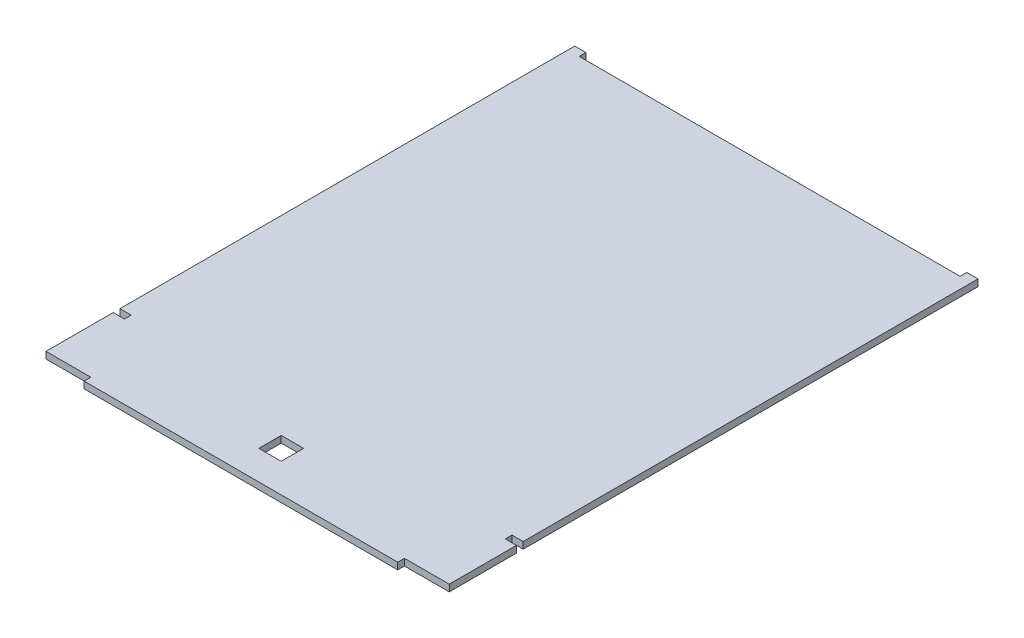
ISO-10303-21;
HEADER;
FILE_DESCRIPTION(('STEP AP214'),'2;1');
FILE_NAME('part.step','',(''),(''),'','','');
FILE_SCHEMA(('AUTOMOTIVE_DESIGN { 1 0 10303 214 1 1 1 1 }'));
ENDSEC;
DATA;
#1=APPLICATION_CONTEXT('core data for automotive mechanical design processes');
#2=APPLICATION_PROTOCOL_DEFINITION('international standard','automotive_design',2000,#1);
#3=PRODUCT_CONTEXT('',#1,'mechanical');
#4=PRODUCT('Part','Part','',(#3));
#5=PRODUCT_RELATED_PRODUCT_CATEGORY('part','',(#4));
#6=PRODUCT_DEFINITION_FORMATION('','',#4);
#7=PRODUCT_DEFINITION_CONTEXT('part definition',#1,'design');
#8=PRODUCT_DEFINITION('design','',#6,#7);
#9=PRODUCT_DEFINITION_SHAPE('','',#8);
#10=(LENGTH_UNIT() NAMED_UNIT(*) SI_UNIT(.MILLI.,.METRE.));
#11=(NAMED_UNIT(*) PLANE_ANGLE_UNIT() SI_UNIT($,.RADIAN.));
#12=(NAMED_UNIT(*) SI_UNIT($,.STERADIAN.) SOLID_ANGLE_UNIT());
#13=UNCERTAINTY_MEASURE_WITH_UNIT(LENGTH_MEASURE(1.E-05),#10,'distance_accuracy_value','');
#14=(GEOMETRIC_REPRESENTATION_CONTEXT(3) GLOBAL_UNCERTAINTY_ASSIGNED_CONTEXT((#13)) GLOBAL_UNIT_ASSIGNED_CONTEXT((#10,
#11,#12)) REPRESENTATION_CONTEXT('',''));
#15=CARTESIAN_POINT('',(0.,0.,0.));
#16=DIRECTION('',(0.,0.,1.));
#17=DIRECTION('',(1.,0.,0.));
#18=AXIS2_PLACEMENT_3D('',#15,#16,#17);
#19=CARTESIAN_POINT('',(0.,3.,3.));
#20=DIRECTION('',(0.,0.,-1.));
#21=DIRECTION('',(-1.,0.,0.));
#22=AXIS2_PLACEMENT_3D('',#19,#20,#21);
#23=PLANE('',#22);
#24=DIRECTION('',(1.,0.,0.));
#25=VECTOR('',#24,1.);
#26=CARTESIAN_POINT('',(0.,0.,3.));
#27=LINE('',#26,#25);
#28=CARTESIAN_POINT('',(160.,0.,3.));
#29=VERTEX_POINT('',#28);
#30=CARTESIAN_POINT('',(180.,0.,3.));
#31=VERTEX_POINT('',#30);
#32=EDGE_CURVE('E257',#29,#31,#27,.T.);
#33=ORIENTED_EDGE('',*,*,#32,.T.);
#34=DIRECTION('',(0.,-1.,0.));
#35=VECTOR('',#34,1.);
#36=CARTESIAN_POINT('',(180.,3.,3.));
#37=LINE('',#36,#35);
#38=CARTESIAN_POINT('',(180.,3.,3.));
#39=VERTEX_POINT('',#38);
#40=EDGE_CURVE('E11',#39,#31,#37,.T.);
#41=ORIENTED_EDGE('',*,*,#40,.F.);
#42=DIRECTION('',(1.,0.,0.));
#43=VECTOR('',#42,1.);
#44=CARTESIAN_POINT('',(0.,3.,3.));
#45=LINE('',#44,#43);
#46=CARTESIAN_POINT('',(160.,3.,3.));
#47=VERTEX_POINT('',#46);
#48=EDGE_CURVE('E414',#47,#39,#45,.T.);
#49=ORIENTED_EDGE('',*,*,#48,.F.);
#50=DIRECTION('',(0.,-1.,0.));
#51=VECTOR('',#50,1.);
#52=CARTESIAN_POINT('',(160.,3.,3.));
#53=LINE('',#52,#51);
#54=EDGE_CURVE('E329',#47,#29,#53,.T.);
#55=ORIENTED_EDGE('',*,*,#54,.T.);
#56=EDGE_LOOP('',(#33,#41,#49,#55));
#57=FACE_BOUND('',#56,.T.);
#58=ADVANCED_FACE('F39',(#57),#23,.F.);
#59=CARTESIAN_POINT('',(180.,3.,0.));
#60=DIRECTION('',(-1.,0.,0.));
#61=DIRECTION('',(0.,0.,1.));
#62=AXIS2_PLACEMENT_3D('',#59,#60,#61);
#63=PLANE('',#62);
#64=DIRECTION('',(0.,0.,-1.));
#65=VECTOR('',#64,1.);
#66=CARTESIAN_POINT('',(180.,0.,0.));
#67=LINE('',#66,#65);
#68=CARTESIAN_POINT('',(180.,0.,-27.));
#69=VERTEX_POINT('',#68);
#70=EDGE_CURVE('E261',#31,#69,#67,.T.);
#71=ORIENTED_EDGE('',*,*,#70,.T.);
#72=DIRECTION('',(0.,-1.,0.));
#73=VECTOR('',#72,1.);
#74=CARTESIAN_POINT('',(180.,3.,-27.));
#75=LINE('',#74,#73);
#76=CARTESIAN_POINT('',(180.,3.,-27.));
#77=VERTEX_POINT('',#76);
#78=EDGE_CURVE('E50',#77,#69,#75,.T.);
#79=ORIENTED_EDGE('',*,*,#78,.F.);
#80=DIRECTION('',(0.,0.,-1.));
#81=VECTOR('',#80,1.);
#82=CARTESIAN_POINT('',(180.,3.,0.));
#83=LINE('',#82,#81);
#84=EDGE_CURVE('E417',#39,#77,#83,.T.);
#85=ORIENTED_EDGE('',*,*,#84,.F.);
#86=ORIENTED_EDGE('',*,*,#40,.T.);
#87=EDGE_LOOP('',(#71,#79,#85,#86));
#88=FACE_BOUND('',#87,.T.);
#89=ADVANCED_FACE('F499',(#88),#63,.F.);
#90=CARTESIAN_POINT('',(0.,3.,-27.));
#91=DIRECTION('',(0.,0.,-1.));
#92=DIRECTION('',(-1.,0.,0.));
#93=AXIS2_PLACEMENT_3D('',#90,#91,#92);
#94=PLANE('',#93);
#95=DIRECTION('',(1.,0.,0.));
#96=VECTOR('',#95,1.);
#97=CARTESIAN_POINT('',(0.,0.,-27.));
#98=LINE('',#97,#96);
#99=CARTESIAN_POINT('',(175.,0.,-27.));
#100=VERTEX_POINT('',#99);
#101=EDGE_CURVE('E265',#100,#69,#98,.T.);
#102=ORIENTED_EDGE('',*,*,#101,.F.);
#103=DIRECTION('',(0.,-1.,0.));
#104=VECTOR('',#103,1.);
#105=CARTESIAN_POINT('',(175.,3.,-27.));
#106=LINE('',#105,#104);
#107=CARTESIAN_POINT('',(175.,3.,-27.));
#108=VERTEX_POINT('',#107);
#109=EDGE_CURVE('E377',#108,#100,#106,.T.);
#110=ORIENTED_EDGE('',*,*,#109,.F.);
#111=DIRECTION('',(1.,0.,0.));
#112=VECTOR('',#111,1.);
#113=CARTESIAN_POINT('',(0.,3.,-27.));
#114=LINE('',#113,#112);
#115=EDGE_CURVE('E423',#108,#77,#114,.T.);
#116=ORIENTED_EDGE('',*,*,#115,.T.);
#117=ORIENTED_EDGE('',*,*,#78,.T.);
#118=EDGE_LOOP('',(#102,#110,#116,#117));
#119=FACE_BOUND('',#118,.T.);
#120=ADVANCED_FACE('F505',(#119),#94,.T.);
#121=CARTESIAN_POINT('',(175.,3.,0.));
#122=DIRECTION('',(1.,0.,0.));
#123=DIRECTION('',(0.,0.,-1.));
#124=AXIS2_PLACEMENT_3D('',#121,#122,#123);
#125=PLANE('',#124);
#126=DIRECTION('',(0.,0.,1.));
#127=VECTOR('',#126,1.);
#128=CARTESIAN_POINT('',(175.,0.,0.));
#129=LINE('',#128,#127);
#130=CARTESIAN_POINT('',(175.,0.,-30.));
#131=VERTEX_POINT('',#130);
#132=EDGE_CURVE('E269',#131,#100,#129,.T.);
#133=ORIENTED_EDGE('',*,*,#132,.F.);
#134=DIRECTION('',(0.,-1.,0.));
#135=VECTOR('',#134,1.);
#136=CARTESIAN_POINT('',(175.,3.,-30.));
#137=LINE('',#136,#135);
#138=CARTESIAN_POINT('',(175.,3.,-30.));
#139=VERTEX_POINT('',#138);
#140=EDGE_CURVE('E374',#139,#131,#137,.T.);
#141=ORIENTED_EDGE('',*,*,#140,.F.);
#142=DIRECTION('',(0.,0.,1.));
#143=VECTOR('',#142,1.);
#144=CARTESIAN_POINT('',(175.,3.,0.));
#145=LINE('',#144,#143);
#146=EDGE_CURVE('E427',#139,#108,#145,.T.);
#147=ORIENTED_EDGE('',*,*,#146,.T.);
#148=ORIENTED_EDGE('',*,*,#109,.T.);
#149=EDGE_LOOP('',(#133,#141,#147,#148));
#150=FACE_BOUND('',#149,.T.);
#151=ADVANCED_FACE('F696',(#150),#125,.T.);
#152=CARTESIAN_POINT('',(0.,3.,-30.));
#153=DIRECTION('',(0.,0.,1.));
#154=DIRECTION('',(1.,0.,0.));
#155=AXIS2_PLACEMENT_3D('',#152,#153,#154);
#156=PLANE('',#155);
#157=DIRECTION('',(-1.,0.,0.));
#158=VECTOR('',#157,1.);
#159=CARTESIAN_POINT('',(0.,0.,-30.));
#160=LINE('',#159,#158);
#161=CARTESIAN_POINT('',(180.,0.,-30.));
#162=VERTEX_POINT('',#161);
#163=EDGE_CURVE('E273',#162,#131,#160,.T.);
#164=ORIENTED_EDGE('',*,*,#163,.F.);
#165=DIRECTION('',(0.,-1.,0.));
#166=VECTOR('',#165,1.);
#167=CARTESIAN_POINT('',(180.,3.,-30.));
#168=LINE('',#167,#166);
#169=CARTESIAN_POINT('',(180.,3.,-30.));
#170=VERTEX_POINT('',#169);
#171=EDGE_CURVE('E371',#170,#162,#168,.T.);
#172=ORIENTED_EDGE('',*,*,#171,.F.);
#173=DIRECTION('',(-1.,0.,0.));
#174=VECTOR('',#173,1.);
#175=CARTESIAN_POINT('',(0.,3.,-30.));
#176=LINE('',#175,#174);
#177=EDGE_CURVE('E431',#170,#139,#176,.T.);
#178=ORIENTED_EDGE('',*,*,#177,.T.);
#179=ORIENTED_EDGE('',*,*,#140,.T.);
#180=EDGE_LOOP('',(#164,#172,#178,#179));
#181=FACE_BOUND('',#180,.T.);
#182=ADVANCED_FACE('F685',(#181),#156,.T.);
#183=CARTESIAN_POINT('',(180.,3.,0.));
#184=DIRECTION('',(-1.,0.,0.));
#185=DIRECTION('',(0.,0.,1.));
#186=AXIS2_PLACEMENT_3D('',#183,#184,#185);
#187=PLANE('',#186);
#188=DIRECTION('',(0.,0.,-1.));
#189=VECTOR('',#188,1.);
#190=CARTESIAN_POINT('',(180.,0.,0.));
#191=LINE('',#190,#189);
#192=CARTESIAN_POINT('',(180.,0.,-233.));
#193=VERTEX_POINT('',#192);
#194=EDGE_CURVE('E277',#162,#193,#191,.T.);
#195=ORIENTED_EDGE('',*,*,#194,.T.);
#196=DIRECTION('',(0.,-1.,0.));
#197=VECTOR('',#196,1.);
#198=CARTESIAN_POINT('',(180.,3.,-233.));
#199=LINE('',#198,#197);
#200=CARTESIAN_POINT('',(180.,3.,-233.));
#201=VERTEX_POINT('',#200);
#202=EDGE_CURVE('E368',#201,#193,#199,.T.);
#203=ORIENTED_EDGE('',*,*,#202,.F.);
#204=DIRECTION('',(0.,0.,-1.));
#205=VECTOR('',#204,1.);
#206=CARTESIAN_POINT('',(180.,3.,0.));
#207=LINE('',#206,#205);
#208=EDGE_CURVE('E435',#170,#201,#207,.T.);
#209=ORIENTED_EDGE('',*,*,#208,.F.);
#210=ORIENTED_EDGE('',*,*,#171,.T.);
#211=EDGE_LOOP('',(#195,#203,#209,#210));
#212=FACE_BOUND('',#211,.T.);
#213=ADVANCED_FACE('F675',(#212),#187,.F.);
#214=CARTESIAN_POINT('',(0.,3.,-233.));
#215=DIRECTION('',(0.,0.,-1.));
#216=DIRECTION('',(-1.,0.,0.));
#217=AXIS2_PLACEMENT_3D('',#214,#215,#216);
#218=PLANE('',#217);
#219=DIRECTION('',(1.,0.,0.));
#220=VECTOR('',#219,1.);
#221=CARTESIAN_POINT('',(0.,0.,-233.));
#222=LINE('',#221,#220);
#223=CARTESIAN_POINT('',(175.,0.,-233.));
#224=VERTEX_POINT('',#223);
#225=EDGE_CURVE('E281',#224,#193,#222,.T.);
#226=ORIENTED_EDGE('',*,*,#225,.F.);
#227=DIRECTION('',(0.,-1.,0.));
#228=VECTOR('',#227,1.);
#229=CARTESIAN_POINT('',(175.,3.,-233.));
#230=LINE('',#229,#228);
#231=CARTESIAN_POINT('',(175.,3.,-233.));
#232=VERTEX_POINT('',#231);
#233=EDGE_CURVE('E365',#232,#224,#230,.T.);
#234=ORIENTED_EDGE('',*,*,#233,.F.);
#235=DIRECTION('',(1.,0.,0.));
#236=VECTOR('',#235,1.);
#237=CARTESIAN_POINT('',(0.,3.,-233.));
#238=LINE('',#237,#236);
#239=EDGE_CURVE('E438',#232,#201,#238,.T.);
#240=ORIENTED_EDGE('',*,*,#239,.T.);
#241=ORIENTED_EDGE('',*,*,#202,.T.);
#242=EDGE_LOOP('',(#226,#234,#240,#241));
#243=FACE_BOUND('',#242,.T.);
#244=ADVANCED_FACE('F665',(#243),#218,.T.);
#245=CARTESIAN_POINT('',(175.,3.,0.));
#246=DIRECTION('',(-1.,0.,0.));
#247=DIRECTION('',(0.,0.,1.));
#248=AXIS2_PLACEMENT_3D('',#245,#246,#247);
#249=PLANE('',#248);
#250=DIRECTION('',(0.,0.,-1.));
#251=VECTOR('',#250,1.);
#252=CARTESIAN_POINT('',(175.,0.,0.));
#253=LINE('',#252,#251);
#254=CARTESIAN_POINT('',(175.,0.,-230.));
#255=VERTEX_POINT('',#254);
#256=EDGE_CURVE('E285',#255,#224,#253,.T.);
#257=ORIENTED_EDGE('',*,*,#256,.F.);
#258=DIRECTION('',(0.,-1.,0.));
#259=VECTOR('',#258,1.);
#260=CARTESIAN_POINT('',(175.,3.,-230.));
#261=LINE('',#260,#259);
#262=CARTESIAN_POINT('',(175.,3.,-230.));
#263=VERTEX_POINT('',#262);
#264=EDGE_CURVE('E362',#263,#255,#261,.T.);
#265=ORIENTED_EDGE('',*,*,#264,.F.);
#266=DIRECTION('',(0.,0.,-1.));
#267=VECTOR('',#266,1.);
#268=CARTESIAN_POINT('',(175.,3.,0.));
#269=LINE('',#268,#267);
#270=EDGE_CURVE('E442',#263,#232,#269,.T.);
#271=ORIENTED_EDGE('',*,*,#270,.T.);
#272=ORIENTED_EDGE('',*,*,#233,.T.);
#273=EDGE_LOOP('',(#257,#265,#271,#272));
#274=FACE_BOUND('',#273,.T.);
#275=ADVANCED_FACE('F655',(#274),#249,.T.);
#276=CARTESIAN_POINT('',(0.,3.,-230.));
#277=DIRECTION('',(0.,0.,-1.));
#278=DIRECTION('',(-1.,0.,0.));
#279=AXIS2_PLACEMENT_3D('',#276,#277,#278);
#280=PLANE('',#279);
#281=DIRECTION('',(1.,0.,0.));
#282=VECTOR('',#281,1.);
#283=CARTESIAN_POINT('',(0.,0.,-230.));
#284=LINE('',#283,#282);
#285=CARTESIAN_POINT('',(5.,0.,-230.));
#286=VERTEX_POINT('',#285);
#287=EDGE_CURVE('E289',#286,#255,#284,.T.);
#288=ORIENTED_EDGE('',*,*,#287,.F.);
#289=DIRECTION('',(0.,-1.,0.));
#290=VECTOR('',#289,1.);
#291=CARTESIAN_POINT('',(5.,3.,-230.));
#292=LINE('',#291,#290);
#293=CARTESIAN_POINT('',(5.,3.,-230.));
#294=VERTEX_POINT('',#293);
#295=EDGE_CURVE('E359',#294,#286,#292,.T.);
#296=ORIENTED_EDGE('',*,*,#295,.F.);
#297=DIRECTION('',(1.,0.,0.));
#298=VECTOR('',#297,1.);
#299=CARTESIAN_POINT('',(0.,3.,-230.));
#300=LINE('',#299,#298);
#301=EDGE_CURVE('E446',#294,#263,#300,.T.);
#302=ORIENTED_EDGE('',*,*,#301,.T.);
#303=ORIENTED_EDGE('',*,*,#264,.T.);
#304=EDGE_LOOP('',(#288,#296,#302,#303));
#305=FACE_BOUND('',#304,.T.);
#306=ADVANCED_FACE('F645',(#305),#280,.T.);
#307=CARTESIAN_POINT('',(4.99999999999993,3.,0.));
#308=DIRECTION('',(1.,0.,0.));
#309=DIRECTION('',(0.,0.,-1.));
#310=AXIS2_PLACEMENT_3D('',#307,#308,#309);
#311=PLANE('',#310);
#312=DIRECTION('',(0.,0.,1.));
#313=VECTOR('',#312,1.);
#314=CARTESIAN_POINT('',(4.99999999999993,0.,0.));
#315=LINE('',#314,#313);
#316=CARTESIAN_POINT('',(5.,0.,-233.));
#317=VERTEX_POINT('',#316);
#318=EDGE_CURVE('E293',#317,#286,#315,.T.);
#319=ORIENTED_EDGE('',*,*,#318,.F.);
#320=DIRECTION('',(0.,-1.,0.));
#321=VECTOR('',#320,1.);
#322=CARTESIAN_POINT('',(5.,3.,-233.));
#323=LINE('',#322,#321);
#324=CARTESIAN_POINT('',(5.,3.,-233.));
#325=VERTEX_POINT('',#324);
#326=EDGE_CURVE('E356',#325,#317,#323,.T.);
#327=ORIENTED_EDGE('',*,*,#326,.F.);
#328=DIRECTION('',(0.,0.,1.));
#329=VECTOR('',#328,1.);
#330=CARTESIAN_POINT('',(4.99999999999993,3.,0.));
#331=LINE('',#330,#329);
#332=EDGE_CURVE('E450',#325,#294,#331,.T.);
#333=ORIENTED_EDGE('',*,*,#332,.T.);
#334=ORIENTED_EDGE('',*,*,#295,.T.);
#335=EDGE_LOOP('',(#319,#327,#333,#334));
#336=FACE_BOUND('',#335,.T.);
#337=ADVANCED_FACE('F635',(#336),#311,.T.);
#338=CARTESIAN_POINT('',(0.,3.,-233.));
#339=DIRECTION('',(0.,0.,-1.));
#340=DIRECTION('',(-1.,0.,0.));
#341=AXIS2_PLACEMENT_3D('',#338,#339,#340);
#342=PLANE('',#341);
#343=DIRECTION('',(1.,0.,0.));
#344=VECTOR('',#343,1.);
#345=CARTESIAN_POINT('',(0.,0.,-233.));
#346=LINE('',#345,#344);
#347=CARTESIAN_POINT('',(0.,0.,-233.));
#348=VERTEX_POINT('',#347);
#349=EDGE_CURVE('E297',#348,#317,#346,.T.);
#350=ORIENTED_EDGE('',*,*,#349,.F.);
#351=DIRECTION('',(0.,-1.,0.));
#352=VECTOR('',#351,1.);
#353=CARTESIAN_POINT('',(0.,3.,-233.));
#354=LINE('',#353,#352);
#355=CARTESIAN_POINT('',(0.,3.,-233.));
#356=VERTEX_POINT('',#355);
#357=EDGE_CURVE('E353',#356,#348,#354,.T.);
#358=ORIENTED_EDGE('',*,*,#357,.F.);
#359=DIRECTION('',(1.,0.,0.));
#360=VECTOR('',#359,1.);
#361=CARTESIAN_POINT('',(0.,3.,-233.));
#362=LINE('',#361,#360);
#363=EDGE_CURVE('E454',#356,#325,#362,.T.);
#364=ORIENTED_EDGE('',*,*,#363,.T.);
#365=ORIENTED_EDGE('',*,*,#326,.T.);
#366=EDGE_LOOP('',(#350,#358,#364,#365));
#367=FACE_BOUND('',#366,.T.);
#368=ADVANCED_FACE('F623',(#367),#342,.T.);
#369=CARTESIAN_POINT('',(0.,3.,0.));
#370=DIRECTION('',(-1.,0.,0.));
#371=DIRECTION('',(0.,0.,1.));
#372=AXIS2_PLACEMENT_3D('',#369,#370,#371);
#373=PLANE('',#372);
#374=DIRECTION('',(0.,0.,-1.));
#375=VECTOR('',#374,1.);
#376=CARTESIAN_POINT('',(0.,0.,0.));
#377=LINE('',#376,#375);
#378=CARTESIAN_POINT('',(0.,0.,-30.));
#379=VERTEX_POINT('',#378);
#380=EDGE_CURVE('E301',#379,#348,#377,.T.);
#381=ORIENTED_EDGE('',*,*,#380,.F.);
#382=DIRECTION('',(0.,-1.,0.));
#383=VECTOR('',#382,1.);
#384=CARTESIAN_POINT('',(0.,3.,-30.));
#385=LINE('',#384,#383);
#386=CARTESIAN_POINT('',(0.,3.,-30.));
#387=VERTEX_POINT('',#386);
#388=EDGE_CURVE('E350',#387,#379,#385,.T.);
#389=ORIENTED_EDGE('',*,*,#388,.F.);
#390=DIRECTION('',(0.,0.,-1.));
#391=VECTOR('',#390,1.);
#392=CARTESIAN_POINT('',(0.,3.,0.));
#393=LINE('',#392,#391);
#394=EDGE_CURVE('E458',#387,#356,#393,.T.);
#395=ORIENTED_EDGE('',*,*,#394,.T.);
#396=ORIENTED_EDGE('',*,*,#357,.T.);
#397=EDGE_LOOP('',(#381,#389,#395,#396));
#398=FACE_BOUND('',#397,.T.);
#399=ADVANCED_FACE('F612',(#398),#373,.T.);
#400=CARTESIAN_POINT('',(0.,3.,-30.));
#401=DIRECTION('',(0.,0.,-1.));
#402=DIRECTION('',(-1.,0.,0.));
#403=AXIS2_PLACEMENT_3D('',#400,#401,#402);
#404=PLANE('',#403);
#405=DIRECTION('',(1.,0.,0.));
#406=VECTOR('',#405,1.);
#407=CARTESIAN_POINT('',(0.,0.,-30.));
#408=LINE('',#407,#406);
#409=CARTESIAN_POINT('',(5.,0.,-30.));
#410=VERTEX_POINT('',#409);
#411=EDGE_CURVE('E305',#379,#410,#408,.T.);
#412=ORIENTED_EDGE('',*,*,#411,.T.);
#413=DIRECTION('',(0.,-1.,0.));
#414=VECTOR('',#413,1.);
#415=CARTESIAN_POINT('',(5.,3.,-30.));
#416=LINE('',#415,#414);
#417=CARTESIAN_POINT('',(5.,3.,-30.));
#418=VERTEX_POINT('',#417);
#419=EDGE_CURVE('E346',#418,#410,#416,.T.);
#420=ORIENTED_EDGE('',*,*,#419,.F.);
#421=DIRECTION('',(1.,0.,0.));
#422=VECTOR('',#421,1.);
#423=CARTESIAN_POINT('',(0.,3.,-30.));
#424=LINE('',#423,#422);
#425=EDGE_CURVE('E462',#387,#418,#424,.T.);
#426=ORIENTED_EDGE('',*,*,#425,.F.);
#427=ORIENTED_EDGE('',*,*,#388,.T.);
#428=EDGE_LOOP('',(#412,#420,#426,#427));
#429=FACE_BOUND('',#428,.T.);
#430=ADVANCED_FACE('F602',(#429),#404,.F.);
#431=CARTESIAN_POINT('',(5.,3.,0.));
#432=DIRECTION('',(1.,0.,0.));
#433=DIRECTION('',(0.,0.,-1.));
#434=AXIS2_PLACEMENT_3D('',#431,#432,#433);
#435=PLANE('',#434);
#436=DIRECTION('',(0.,0.,1.));
#437=VECTOR('',#436,1.);
#438=CARTESIAN_POINT('',(5.,0.,0.));
#439=LINE('',#438,#437);
#440=CARTESIAN_POINT('',(5.,0.,-27.));
#441=VERTEX_POINT('',#440);
#442=EDGE_CURVE('E308',#410,#441,#439,.T.);
#443=ORIENTED_EDGE('',*,*,#442,.T.);
#444=DIRECTION('',(0.,-1.,0.));
#445=VECTOR('',#444,1.);
#446=CARTESIAN_POINT('',(5.,3.,-27.));
#447=LINE('',#446,#445);
#448=CARTESIAN_POINT('',(5.,3.,-27.));
#449=VERTEX_POINT('',#448);
#450=EDGE_CURVE('E342',#449,#441,#447,.T.);
#451=ORIENTED_EDGE('',*,*,#450,.F.);
#452=DIRECTION('',(0.,0.,1.));
#453=VECTOR('',#452,1.);
#454=CARTESIAN_POINT('',(5.,3.,0.));
#455=LINE('',#454,#453);
#456=EDGE_CURVE('E465',#418,#449,#455,.T.);
#457=ORIENTED_EDGE('',*,*,#456,.F.);
#458=ORIENTED_EDGE('',*,*,#419,.T.);
#459=EDGE_LOOP('',(#443,#451,#457,#458));
#460=FACE_BOUND('',#459,.T.);
#461=ADVANCED_FACE('F593',(#460),#435,.F.);
#462=CARTESIAN_POINT('',(0.,3.,-27.));
#463=DIRECTION('',(0.,0.,1.));
#464=DIRECTION('',(1.,0.,0.));
#465=AXIS2_PLACEMENT_3D('',#462,#463,#464);
#466=PLANE('',#465);
#467=DIRECTION('',(-1.,0.,0.));
#468=VECTOR('',#467,1.);
#469=CARTESIAN_POINT('',(0.,0.,-27.));
#470=LINE('',#469,#468);
#471=CARTESIAN_POINT('',(0.,0.,-27.));
#472=VERTEX_POINT('',#471);
#473=EDGE_CURVE('E311',#441,#472,#470,.T.);
#474=ORIENTED_EDGE('',*,*,#473,.T.);
#475=DIRECTION('',(0.,-1.,0.));
#476=VECTOR('',#475,1.);
#477=CARTESIAN_POINT('',(0.,3.,-27.));
#478=LINE('',#477,#476);
#479=CARTESIAN_POINT('',(0.,3.,-27.));
#480=VERTEX_POINT('',#479);
#481=EDGE_CURVE('E339',#480,#472,#478,.T.);
#482=ORIENTED_EDGE('',*,*,#481,.F.);
#483=DIRECTION('',(-1.,0.,0.));
#484=VECTOR('',#483,1.);
#485=CARTESIAN_POINT('',(0.,3.,-27.));
#486=LINE('',#485,#484);
#487=EDGE_CURVE('E468',#449,#480,#486,.T.);
#488=ORIENTED_EDGE('',*,*,#487,.F.);
#489=ORIENTED_EDGE('',*,*,#450,.T.);
#490=EDGE_LOOP('',(#474,#482,#488,#489));
#491=FACE_BOUND('',#490,.T.);
#492=ADVANCED_FACE('F483',(#491),#466,.F.);
#493=CARTESIAN_POINT('',(0.,3.,0.));
#494=DIRECTION('',(-1.,0.,0.));
#495=DIRECTION('',(0.,0.,1.));
#496=AXIS2_PLACEMENT_3D('',#493,#494,#495);
#497=PLANE('',#496);
#498=DIRECTION('',(0.,0.,-1.));
#499=VECTOR('',#498,1.);
#500=CARTESIAN_POINT('',(0.,0.,0.));
#501=LINE('',#500,#499);
#502=CARTESIAN_POINT('',(0.,0.,3.));
#503=VERTEX_POINT('',#502);
#504=EDGE_CURVE('E315',#503,#472,#501,.T.);
#505=ORIENTED_EDGE('',*,*,#504,.F.);
#506=DIRECTION('',(0.,-1.,0.));
#507=VECTOR('',#506,1.);
#508=CARTESIAN_POINT('',(0.,3.,3.));
#509=LINE('',#508,#507);
#510=CARTESIAN_POINT('',(0.,3.,3.));
#511=VERTEX_POINT('',#510);
#512=EDGE_CURVE('E336',#511,#503,#509,.T.);
#513=ORIENTED_EDGE('',*,*,#512,.F.);
#514=DIRECTION('',(0.,0.,-1.));
#515=VECTOR('',#514,1.);
#516=CARTESIAN_POINT('',(0.,3.,0.));
#517=LINE('',#516,#515);
#518=EDGE_CURVE('E471',#511,#480,#517,.T.);
#519=ORIENTED_EDGE('',*,*,#518,.T.);
#520=ORIENTED_EDGE('',*,*,#481,.T.);
#521=EDGE_LOOP('',(#505,#513,#519,#520));
#522=FACE_BOUND('',#521,.T.);
#523=ADVANCED_FACE('F477',(#522),#497,.T.);
#524=CARTESIAN_POINT('',(0.,3.,3.));
#525=DIRECTION('',(0.,0.,-1.));
#526=DIRECTION('',(-1.,0.,0.));
#527=AXIS2_PLACEMENT_3D('',#524,#525,#526);
#528=PLANE('',#527);
#529=DIRECTION('',(1.,0.,0.));
#530=VECTOR('',#529,1.);
#531=CARTESIAN_POINT('',(0.,0.,3.));
#532=LINE('',#531,#530);
#533=CARTESIAN_POINT('',(20.,0.,3.));
#534=VERTEX_POINT('',#533);
#535=EDGE_CURVE('E319',#503,#534,#532,.T.);
#536=ORIENTED_EDGE('',*,*,#535,.T.);
#537=DIRECTION('',(0.,-1.,0.));
#538=VECTOR('',#537,1.);
#539=CARTESIAN_POINT('',(20.,3.,3.));
#540=LINE('',#539,#538);
#541=CARTESIAN_POINT('',(20.,3.,3.));
#542=VERTEX_POINT('',#541);
#543=EDGE_CURVE('E230',#542,#534,#540,.T.);
#544=ORIENTED_EDGE('',*,*,#543,.F.);
#545=DIRECTION('',(1.,0.,0.));
#546=VECTOR('',#545,1.);
#547=CARTESIAN_POINT('',(0.,3.,3.));
#548=LINE('',#547,#546);
#549=EDGE_CURVE('E219',#511,#542,#548,.T.);
#550=ORIENTED_EDGE('',*,*,#549,.F.);
#551=ORIENTED_EDGE('',*,*,#512,.T.);
#552=EDGE_LOOP('',(#536,#544,#550,#551));
#553=FACE_BOUND('',#552,.T.);
#554=ADVANCED_FACE('F489',(#553),#528,.F.);
#555=CARTESIAN_POINT('',(20.,3.,0.));
#556=DIRECTION('',(1.,0.,0.));
#557=DIRECTION('',(0.,0.,-1.));
#558=AXIS2_PLACEMENT_3D('',#555,#556,#557);
#559=PLANE('',#558);
#560=DIRECTION('',(0.,0.,1.));
#561=VECTOR('',#560,1.);
#562=CARTESIAN_POINT('',(20.,0.,0.));
#563=LINE('',#562,#561);
#564=CARTESIAN_POINT('',(20.,0.,6.));
#565=VERTEX_POINT('',#564);
#566=EDGE_CURVE('E228',#534,#565,#563,.T.);
#567=ORIENTED_EDGE('',*,*,#566,.T.);
#568=DIRECTION('',(0.,-1.,0.));
#569=VECTOR('',#568,1.);
#570=CARTESIAN_POINT('',(20.,3.,6.));
#571=LINE('',#570,#569);
#572=CARTESIAN_POINT('',(20.,3.,6.));
#573=VERTEX_POINT('',#572);
#574=EDGE_CURVE('E225',#573,#565,#571,.T.);
#575=ORIENTED_EDGE('',*,*,#574,.F.);
#576=DIRECTION('',(0.,0.,1.));
#577=VECTOR('',#576,1.);
#578=CARTESIAN_POINT('',(20.,3.,0.));
#579=LINE('',#578,#577);
#580=EDGE_CURVE('E212',#542,#573,#579,.T.);
#581=ORIENTED_EDGE('',*,*,#580,.F.);
#582=ORIENTED_EDGE('',*,*,#543,.T.);
#583=EDGE_LOOP('',(#567,#575,#581,#582));
#584=FACE_BOUND('',#583,.T.);
#585=ADVANCED_FACE('F226',(#584),#559,.F.);
#586=CARTESIAN_POINT('',(0.,3.,6.));
#587=DIRECTION('',(0.,0.,-1.));
#588=DIRECTION('',(-1.,0.,0.));
#589=AXIS2_PLACEMENT_3D('',#586,#587,#588);
#590=PLANE('',#589);
#591=DIRECTION('',(1.,0.,0.));
#592=VECTOR('',#591,1.);
#593=CARTESIAN_POINT('',(0.,0.,6.));
#594=LINE('',#593,#592);
#595=CARTESIAN_POINT('',(160.,0.,6.));
#596=VERTEX_POINT('',#595);
#597=EDGE_CURVE('E136',#565,#596,#594,.T.);
#598=ORIENTED_EDGE('',*,*,#597,.T.);
#599=DIRECTION('',(0.,-1.,0.));
#600=VECTOR('',#599,1.);
#601=CARTESIAN_POINT('',(160.,3.,6.));
#602=LINE('',#601,#600);
#603=CARTESIAN_POINT('',(160.,3.,6.));
#604=VERTEX_POINT('',#603);
#605=EDGE_CURVE('E231',#604,#596,#602,.T.);
#606=ORIENTED_EDGE('',*,*,#605,.F.);
#607=DIRECTION('',(1.,0.,0.));
#608=VECTOR('',#607,1.);
#609=CARTESIAN_POINT('',(0.,3.,6.));
#610=LINE('',#609,#608);
#611=EDGE_CURVE('E216',#573,#604,#610,.T.);
#612=ORIENTED_EDGE('',*,*,#611,.F.);
#613=ORIENTED_EDGE('',*,*,#574,.T.);
#614=EDGE_LOOP('',(#598,#606,#612,#613));
#615=FACE_BOUND('',#614,.T.);
#616=ADVANCED_FACE('F233',(#615),#590,.F.);
#617=CARTESIAN_POINT('',(85.,3.,0.));
#618=DIRECTION('',(1.,0.,0.));
#619=DIRECTION('',(0.,0.,-1.));
#620=AXIS2_PLACEMENT_3D('',#617,#618,#619);
#621=PLANE('',#620);
#622=DIRECTION('',(0.,0.,1.));
#623=VECTOR('',#622,1.);
#624=CARTESIAN_POINT('',(85.,0.,0.));
#625=LINE('',#624,#623);
#626=CARTESIAN_POINT('',(85.,0.,-17.));
#627=VERTEX_POINT('',#626);
#628=CARTESIAN_POINT('',(85.,0.,-7.));
#629=VERTEX_POINT('',#628);
#630=EDGE_CURVE('E241',#627,#629,#625,.T.);
#631=ORIENTED_EDGE('',*,*,#630,.F.);
#632=DIRECTION('',(0.,-1.,0.));
#633=VECTOR('',#632,1.);
#634=CARTESIAN_POINT('',(85.,3.,-17.));
#635=LINE('',#634,#633);
#636=CARTESIAN_POINT('',(85.,3.,-17.));
#637=VERTEX_POINT('',#636);
#638=EDGE_CURVE('E43',#637,#627,#635,.T.);
#639=ORIENTED_EDGE('',*,*,#638,.F.);
#640=DIRECTION('',(0.,0.,1.));
#641=VECTOR('',#640,1.);
#642=CARTESIAN_POINT('',(85.,3.,0.));
#643=LINE('',#642,#641);
#644=CARTESIAN_POINT('',(85.,3.,-7.));
#645=VERTEX_POINT('',#644);
#646=EDGE_CURVE('E328',#637,#645,#643,.T.);
#647=ORIENTED_EDGE('',*,*,#646,.T.);
#648=DIRECTION('',(0.,-1.,0.));
#649=VECTOR('',#648,1.);
#650=CARTESIAN_POINT('',(85.,3.,-7.));
#651=LINE('',#650,#649);
#652=EDGE_CURVE('E237',#645,#629,#651,.T.);
#653=ORIENTED_EDGE('',*,*,#652,.T.);
#654=EDGE_LOOP('',(#631,#639,#647,#653));
#655=FACE_BOUND('',#654,.T.);
#656=ADVANCED_FACE('F41',(#655),#621,.T.);
#657=CARTESIAN_POINT('',(0.,3.,-17.));
#658=DIRECTION('',(0.,0.,1.));
#659=DIRECTION('',(1.,0.,0.));
#660=AXIS2_PLACEMENT_3D('',#657,#658,#659);
#661=PLANE('',#660);
#662=DIRECTION('',(-1.,0.,0.));
#663=VECTOR('',#662,1.);
#664=CARTESIAN_POINT('',(0.,0.,-17.));
#665=LINE('',#664,#663);
#666=CARTESIAN_POINT('',(95.,0.,-17.));
#667=VERTEX_POINT('',#666);
#668=EDGE_CURVE('E245',#667,#627,#665,.T.);
#669=ORIENTED_EDGE('',*,*,#668,.F.);
#670=DIRECTION('',(0.,-1.,0.));
#671=VECTOR('',#670,1.);
#672=CARTESIAN_POINT('',(95.,3.,-17.));
#673=LINE('',#672,#671);
#674=CARTESIAN_POINT('',(95.,3.,-17.));
#675=VERTEX_POINT('',#674);
#676=EDGE_CURVE('E386',#675,#667,#673,.T.);
#677=ORIENTED_EDGE('',*,*,#676,.F.);
#678=DIRECTION('',(-1.,0.,0.));
#679=VECTOR('',#678,1.);
#680=CARTESIAN_POINT('',(0.,3.,-17.));
#681=LINE('',#680,#679);
#682=EDGE_CURVE('E397',#675,#637,#681,.T.);
#683=ORIENTED_EDGE('',*,*,#682,.T.);
#684=ORIENTED_EDGE('',*,*,#638,.T.);
#685=EDGE_LOOP('',(#669,#677,#683,#684));
#686=FACE_BOUND('',#685,.T.);
#687=ADVANCED_FACE('F395',(#686),#661,.T.);
#688=CARTESIAN_POINT('',(95.,3.,0.));
#689=DIRECTION('',(-1.,0.,0.));
#690=DIRECTION('',(0.,0.,1.));
#691=AXIS2_PLACEMENT_3D('',#688,#689,#690);
#692=PLANE('',#691);
#693=DIRECTION('',(0.,0.,-1.));
#694=VECTOR('',#693,1.);
#695=CARTESIAN_POINT('',(95.,0.,0.));
#696=LINE('',#695,#694);
#697=CARTESIAN_POINT('',(95.,0.,-7.));
#698=VERTEX_POINT('',#697);
#699=EDGE_CURVE('E249',#698,#667,#696,.T.);
#700=ORIENTED_EDGE('',*,*,#699,.F.);
#701=DIRECTION('',(0.,-1.,0.));
#702=VECTOR('',#701,1.);
#703=CARTESIAN_POINT('',(95.,3.,-7.));
#704=LINE('',#703,#702);
#705=CARTESIAN_POINT('',(95.,3.,-7.));
#706=VERTEX_POINT('',#705);
#707=EDGE_CURVE('E384',#706,#698,#704,.T.);
#708=ORIENTED_EDGE('',*,*,#707,.F.);
#709=DIRECTION('',(0.,0.,-1.));
#710=VECTOR('',#709,1.);
#711=CARTESIAN_POINT('',(95.,3.,0.));
#712=LINE('',#711,#710);
#713=EDGE_CURVE('E404',#706,#675,#712,.T.);
#714=ORIENTED_EDGE('',*,*,#713,.T.);
#715=ORIENTED_EDGE('',*,*,#676,.T.);
#716=EDGE_LOOP('',(#700,#708,#714,#715));
#717=FACE_BOUND('',#716,.T.);
#718=ADVANCED_FACE('F402',(#717),#692,.T.);
#719=CARTESIAN_POINT('',(0.,3.,-7.));
#720=DIRECTION('',(0.,0.,-1.));
#721=DIRECTION('',(-1.,0.,0.));
#722=AXIS2_PLACEMENT_3D('',#719,#720,#721);
#723=PLANE('',#722);
#724=DIRECTION('',(1.,0.,0.));
#725=VECTOR('',#724,1.);
#726=CARTESIAN_POINT('',(0.,0.,-7.));
#727=LINE('',#726,#725);
#728=EDGE_CURVE('E253',#629,#698,#727,.T.);
#729=ORIENTED_EDGE('',*,*,#728,.F.);
#730=ORIENTED_EDGE('',*,*,#652,.F.);
#731=DIRECTION('',(1.,0.,0.));
#732=VECTOR('',#731,1.);
#733=CARTESIAN_POINT('',(0.,3.,-7.));
#734=LINE('',#733,#732);
#735=EDGE_CURVE('E409',#645,#706,#734,.T.);
#736=ORIENTED_EDGE('',*,*,#735,.T.);
#737=ORIENTED_EDGE('',*,*,#707,.T.);
#738=EDGE_LOOP('',(#729,#730,#736,#737));
#739=FACE_BOUND('',#738,.T.);
#740=ADVANCED_FACE('F412',(#739),#723,.T.);
#741=CARTESIAN_POINT('',(160.,3.,0.));
#742=DIRECTION('',(-1.,0.,0.));
#743=DIRECTION('',(0.,0.,1.));
#744=AXIS2_PLACEMENT_3D('',#741,#742,#743);
#745=PLANE('',#744);
#746=DIRECTION('',(0.,0.,-1.));
#747=VECTOR('',#746,1.);
#748=CARTESIAN_POINT('',(160.,0.,0.));
#749=LINE('',#748,#747);
#750=EDGE_CURVE('E142',#596,#29,#749,.T.);
#751=ORIENTED_EDGE('',*,*,#750,.T.);
#752=ORIENTED_EDGE('',*,*,#54,.F.);
#753=DIRECTION('',(0.,0.,-1.));
#754=VECTOR('',#753,1.);
#755=CARTESIAN_POINT('',(160.,3.,0.));
#756=LINE('',#755,#754);
#757=EDGE_CURVE('E59',#604,#47,#756,.T.);
#758=ORIENTED_EDGE('',*,*,#757,.F.);
#759=ORIENTED_EDGE('',*,*,#605,.T.);
#760=EDGE_LOOP('',(#751,#752,#758,#759));
#761=FACE_BOUND('',#760,.T.);
#762=ADVANCED_FACE('F512',(#761),#745,.F.);
#763=CARTESIAN_POINT('',(0.,3.,0.));
#764=DIRECTION('',(0.,1.,0.));
#765=DIRECTION('',(0.,0.,1.));
#766=AXIS2_PLACEMENT_3D('',#763,#764,#765);
#767=PLANE('',#766);
#768=ORIENTED_EDGE('',*,*,#646,.F.);
#769=ORIENTED_EDGE('',*,*,#682,.F.);
#770=ORIENTED_EDGE('',*,*,#713,.F.);
#771=ORIENTED_EDGE('',*,*,#735,.F.);
#772=EDGE_LOOP('',(#768,#769,#770,#771));
#773=FACE_BOUND('',#772,.T.);
#774=ORIENTED_EDGE('',*,*,#48,.T.);
#775=ORIENTED_EDGE('',*,*,#84,.T.);
#776=ORIENTED_EDGE('',*,*,#115,.F.);
#777=ORIENTED_EDGE('',*,*,#146,.F.);
#778=ORIENTED_EDGE('',*,*,#177,.F.);
#779=ORIENTED_EDGE('',*,*,#208,.T.);
#780=ORIENTED_EDGE('',*,*,#239,.F.);
#781=ORIENTED_EDGE('',*,*,#270,.F.);
#782=ORIENTED_EDGE('',*,*,#301,.F.);
#783=ORIENTED_EDGE('',*,*,#332,.F.);
#784=ORIENTED_EDGE('',*,*,#363,.F.);
#785=ORIENTED_EDGE('',*,*,#394,.F.);
#786=ORIENTED_EDGE('',*,*,#425,.T.);
#787=ORIENTED_EDGE('',*,*,#456,.T.);
#788=ORIENTED_EDGE('',*,*,#487,.T.);
#789=ORIENTED_EDGE('',*,*,#518,.F.);
#790=ORIENTED_EDGE('',*,*,#549,.T.);
#791=ORIENTED_EDGE('',*,*,#580,.T.);
#792=ORIENTED_EDGE('',*,*,#611,.T.);
#793=ORIENTED_EDGE('',*,*,#757,.T.);
#794=EDGE_LOOP('',(#774,#775,#776,#777,#778,#779,#780,#781,#782,#783,#784,#785,#786,#787,#788,
#789,#790,#791,#792,#793));
#795=FACE_BOUND('',#794,.T.);
#796=ADVANCED_FACE('F214',(#773,#795),#767,.T.);
#797=CARTESIAN_POINT('',(0.,0.,0.));
#798=DIRECTION('',(0.,1.,0.));
#799=DIRECTION('',(0.,0.,1.));
#800=AXIS2_PLACEMENT_3D('',#797,#798,#799);
#801=PLANE('',#800);
#802=ORIENTED_EDGE('',*,*,#630,.T.);
#803=ORIENTED_EDGE('',*,*,#728,.T.);
#804=ORIENTED_EDGE('',*,*,#699,.T.);
#805=ORIENTED_EDGE('',*,*,#668,.T.);
#806=EDGE_LOOP('',(#802,#803,#804,#805));
#807=FACE_BOUND('',#806,.T.);
#808=ORIENTED_EDGE('',*,*,#32,.F.);
#809=ORIENTED_EDGE('',*,*,#750,.F.);
#810=ORIENTED_EDGE('',*,*,#597,.F.);
#811=ORIENTED_EDGE('',*,*,#566,.F.);
#812=ORIENTED_EDGE('',*,*,#535,.F.);
#813=ORIENTED_EDGE('',*,*,#504,.T.);
#814=ORIENTED_EDGE('',*,*,#473,.F.);
#815=ORIENTED_EDGE('',*,*,#442,.F.);
#816=ORIENTED_EDGE('',*,*,#411,.F.);
#817=ORIENTED_EDGE('',*,*,#380,.T.);
#818=ORIENTED_EDGE('',*,*,#349,.T.);
#819=ORIENTED_EDGE('',*,*,#318,.T.);
#820=ORIENTED_EDGE('',*,*,#287,.T.);
#821=ORIENTED_EDGE('',*,*,#256,.T.);
#822=ORIENTED_EDGE('',*,*,#225,.T.);
#823=ORIENTED_EDGE('',*,*,#194,.F.);
#824=ORIENTED_EDGE('',*,*,#163,.T.);
#825=ORIENTED_EDGE('',*,*,#132,.T.);
#826=ORIENTED_EDGE('',*,*,#101,.T.);
#827=ORIENTED_EDGE('',*,*,#70,.F.);
#828=EDGE_LOOP('',(#808,#809,#810,#811,#812,#813,#814,#815,#816,#817,#818,#819,#820,#821,#822,
#823,#824,#825,#826,#827));
#829=FACE_BOUND('',#828,.T.);
#830=ADVANCED_FACE('F400',(#807,#829),#801,.F.);
#831=CLOSED_SHELL('',(#58,#89,#120,#151,#182,#213,#244,#275,#306,#337,#368,#399,#430,#461,#492,
#523,#554,#585,#616,#656,#687,#718,#740,#762,#796,#830));
#832=MANIFOLD_SOLID_BREP('B2',#831);
#833=ADVANCED_BREP_SHAPE_REPRESENTATION('',(#18,#832),#14);
#834=SHAPE_DEFINITION_REPRESENTATION(#9,#833);
ENDSEC;
END-ISO-10303-21;
